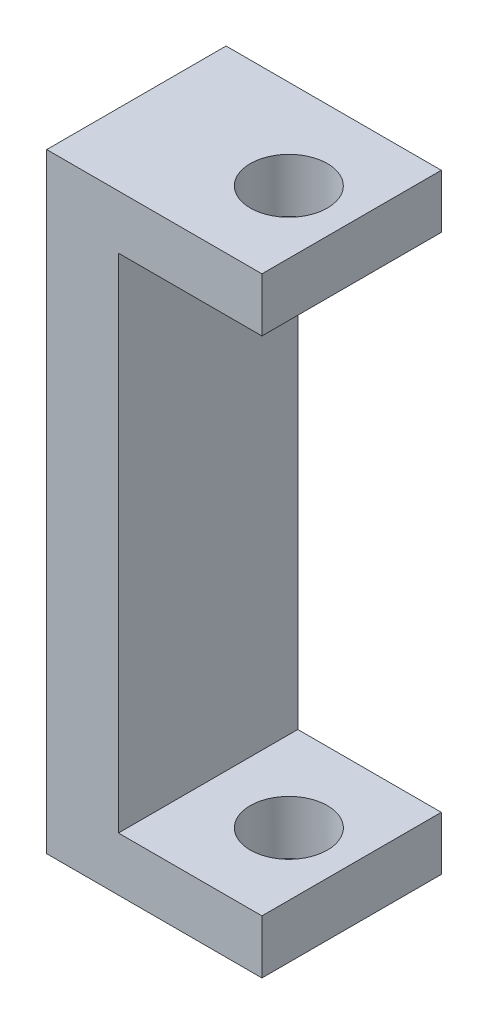
ISO-10303-21;
HEADER;
FILE_DESCRIPTION(('STEP AP214'),'2;1');
FILE_NAME('part.step','',(''),(''),'','','');
FILE_SCHEMA(('AUTOMOTIVE_DESIGN { 1 0 10303 214 1 1 1 1 }'));
ENDSEC;
DATA;
#1=APPLICATION_CONTEXT('core data for automotive mechanical design processes');
#2=APPLICATION_PROTOCOL_DEFINITION('international standard','automotive_design',2000,#1);
#3=PRODUCT_CONTEXT('',#1,'mechanical');
#4=PRODUCT('Part','Part','',(#3));
#5=PRODUCT_RELATED_PRODUCT_CATEGORY('part','',(#4));
#6=PRODUCT_DEFINITION_FORMATION('','',#4);
#7=PRODUCT_DEFINITION_CONTEXT('part definition',#1,'design');
#8=PRODUCT_DEFINITION('design','',#6,#7);
#9=PRODUCT_DEFINITION_SHAPE('','',#8);
#10=(LENGTH_UNIT() NAMED_UNIT(*) SI_UNIT(.MILLI.,.METRE.));
#11=(NAMED_UNIT(*) PLANE_ANGLE_UNIT() SI_UNIT($,.RADIAN.));
#12=(NAMED_UNIT(*) SI_UNIT($,.STERADIAN.) SOLID_ANGLE_UNIT());
#13=UNCERTAINTY_MEASURE_WITH_UNIT(LENGTH_MEASURE(1.E-05),#10,'distance_accuracy_value','');
#14=(GEOMETRIC_REPRESENTATION_CONTEXT(3) GLOBAL_UNCERTAINTY_ASSIGNED_CONTEXT((#13)) GLOBAL_UNIT_ASSIGNED_CONTEXT((#10,
#11,#12)) REPRESENTATION_CONTEXT('',''));
#15=CARTESIAN_POINT('',(0.,0.,0.));
#16=DIRECTION('',(0.,0.,1.));
#17=DIRECTION('',(1.,0.,0.));
#18=AXIS2_PLACEMENT_3D('',#15,#16,#17);
#19=CARTESIAN_POINT('',(6.,-17.,5.));
#20=DIRECTION('',(-1.,0.,0.));
#21=DIRECTION('',(0.,0.,1.));
#22=AXIS2_PLACEMENT_3D('',#19,#20,#21);
#23=PLANE('',#22);
#24=DIRECTION('',(0.,1.,0.));
#25=VECTOR('',#24,1.);
#26=CARTESIAN_POINT('',(6.,-17.,-5.));
#27=LINE('',#26,#25);
#28=CARTESIAN_POINT('',(6.,-17.,-5.));
#29=VERTEX_POINT('',#28);
#30=CARTESIAN_POINT('',(6.,-14.,-5.));
#31=VERTEX_POINT('',#30);
#32=EDGE_CURVE('E160',#29,#31,#27,.T.);
#33=ORIENTED_EDGE('',*,*,#32,.T.);
#34=DIRECTION('',(0.,0.,1.));
#35=VECTOR('',#34,1.);
#36=CARTESIAN_POINT('',(6.,-14.,5.));
#37=LINE('',#36,#35);
#38=CARTESIAN_POINT('',(6.,-14.,5.));
#39=VERTEX_POINT('',#38);
#40=EDGE_CURVE('E123',#31,#39,#37,.T.);
#41=ORIENTED_EDGE('',*,*,#40,.T.);
#42=DIRECTION('',(0.,1.,0.));
#43=VECTOR('',#42,1.);
#44=CARTESIAN_POINT('',(6.,-17.,5.));
#45=LINE('',#44,#43);
#46=CARTESIAN_POINT('',(6.,-17.,5.));
#47=VERTEX_POINT('',#46);
#48=EDGE_CURVE('E150',#47,#39,#45,.T.);
#49=ORIENTED_EDGE('',*,*,#48,.F.);
#50=DIRECTION('',(0.,0.,-1.));
#51=VECTOR('',#50,1.);
#52=CARTESIAN_POINT('',(6.,-17.,5.));
#53=LINE('',#52,#51);
#54=EDGE_CURVE('E166',#47,#29,#53,.T.);
#55=ORIENTED_EDGE('',*,*,#54,.T.);
#56=EDGE_LOOP('',(#33,#41,#49,#55));
#57=FACE_BOUND('',#56,.T.);
#58=ADVANCED_FACE('F34',(#57),#23,.F.);
#59=CARTESIAN_POINT('',(-6.,-17.,5.));
#60=DIRECTION('',(1.,0.,0.));
#61=DIRECTION('',(0.,1.,0.));
#62=AXIS2_PLACEMENT_3D('',#59,#60,#61);
#63=PLANE('',#62);
#64=DIRECTION('',(0.,-1.,0.));
#65=VECTOR('',#64,1.);
#66=CARTESIAN_POINT('',(-6.,-17.,-5.));
#67=LINE('',#66,#65);
#68=CARTESIAN_POINT('',(-6.,17.,-5.));
#69=VERTEX_POINT('',#68);
#70=CARTESIAN_POINT('',(-6.,-17.,-5.));
#71=VERTEX_POINT('',#70);
#72=EDGE_CURVE('E145',#69,#71,#67,.T.);
#73=ORIENTED_EDGE('',*,*,#72,.T.);
#74=DIRECTION('',(0.,0.,-1.));
#75=VECTOR('',#74,1.);
#76=CARTESIAN_POINT('',(-6.,-17.,5.));
#77=LINE('',#76,#75);
#78=CARTESIAN_POINT('',(-6.,-17.,5.));
#79=VERTEX_POINT('',#78);
#80=EDGE_CURVE('E43',#79,#71,#77,.T.);
#81=ORIENTED_EDGE('',*,*,#80,.F.);
#82=DIRECTION('',(0.,-1.,0.));
#83=VECTOR('',#82,1.);
#84=CARTESIAN_POINT('',(-6.,-17.,5.));
#85=LINE('',#84,#83);
#86=CARTESIAN_POINT('',(-6.,17.,5.));
#87=VERTEX_POINT('',#86);
#88=EDGE_CURVE('E146',#87,#79,#85,.T.);
#89=ORIENTED_EDGE('',*,*,#88,.F.);
#90=DIRECTION('',(0.,0.,-1.));
#91=VECTOR('',#90,1.);
#92=CARTESIAN_POINT('',(-6.,17.,5.));
#93=LINE('',#92,#91);
#94=EDGE_CURVE('E154',#87,#69,#93,.T.);
#95=ORIENTED_EDGE('',*,*,#94,.T.);
#96=EDGE_LOOP('',(#73,#81,#89,#95));
#97=FACE_BOUND('',#96,.T.);
#98=ADVANCED_FACE('F36',(#97),#63,.F.);
#99=CARTESIAN_POINT('',(6.,-17.,5.));
#100=DIRECTION('',(0.,1.,0.));
#101=DIRECTION('',(0.,0.,1.));
#102=AXIS2_PLACEMENT_3D('',#99,#100,#101);
#103=PLANE('',#102);
#104=CARTESIAN_POINT('',(2.5,-17.,0.));
#105=DIRECTION('',(0.,1.,0.));
#106=DIRECTION('',(0.,0.,1.));
#107=AXIS2_PLACEMENT_3D('',#104,#105,#106);
#108=CIRCLE('',#107,2.15);
#109=CARTESIAN_POINT('',(2.5,-17.,2.15));
#110=VERTEX_POINT('',#109);
#111=EDGE_CURVE('E205',#110,#110,#108,.T.);
#112=ORIENTED_EDGE('',*,*,#111,.T.);
#113=EDGE_LOOP('',(#112));
#114=FACE_BOUND('',#113,.T.);
#115=DIRECTION('',(1.,0.,0.));
#116=VECTOR('',#115,1.);
#117=CARTESIAN_POINT('',(6.,-17.,-5.));
#118=LINE('',#117,#116);
#119=EDGE_CURVE('E157',#71,#29,#118,.T.);
#120=ORIENTED_EDGE('',*,*,#119,.T.);
#121=ORIENTED_EDGE('',*,*,#54,.F.);
#122=DIRECTION('',(1.,0.,0.));
#123=VECTOR('',#122,1.);
#124=CARTESIAN_POINT('',(6.,-17.,5.));
#125=LINE('',#124,#123);
#126=EDGE_CURVE('E88',#79,#47,#125,.T.);
#127=ORIENTED_EDGE('',*,*,#126,.F.);
#128=ORIENTED_EDGE('',*,*,#80,.T.);
#129=EDGE_LOOP('',(#120,#121,#127,#128));
#130=FACE_BOUND('',#129,.T.);
#131=ADVANCED_FACE('F170',(#114,#130),#103,.F.);
#132=CARTESIAN_POINT('',(6.,14.,5.));
#133=VERTEX_POINT('',#132);
#134=CARTESIAN_POINT('',(6.,17.,5.));
#135=VERTEX_POINT('',#134);
#136=EDGE_CURVE('E149',#133,#135,#45,.T.);
#137=ORIENTED_EDGE('',*,*,#136,.F.);
#138=DIRECTION('',(0.,0.,-1.));
#139=VECTOR('',#138,1.);
#140=CARTESIAN_POINT('',(6.,14.,5.));
#141=LINE('',#140,#139);
#142=CARTESIAN_POINT('',(6.,14.,-5.));
#143=VERTEX_POINT('',#142);
#144=EDGE_CURVE('E138',#133,#143,#141,.T.);
#145=ORIENTED_EDGE('',*,*,#144,.T.);
#146=CARTESIAN_POINT('',(6.,17.,-5.));
#147=VERTEX_POINT('',#146);
#148=EDGE_CURVE('E159',#143,#147,#27,.T.);
#149=ORIENTED_EDGE('',*,*,#148,.T.);
#150=DIRECTION('',(0.,0.,-1.));
#151=VECTOR('',#150,1.);
#152=CARTESIAN_POINT('',(6.,17.,5.));
#153=LINE('',#152,#151);
#154=EDGE_CURVE('E164',#135,#147,#153,.T.);
#155=ORIENTED_EDGE('',*,*,#154,.F.);
#156=EDGE_LOOP('',(#137,#145,#149,#155));
#157=FACE_BOUND('',#156,.T.);
#158=ADVANCED_FACE('F182',(#157),#23,.F.);
#159=CARTESIAN_POINT('',(6.,17.,5.));
#160=DIRECTION('',(0.,-1.,0.));
#161=DIRECTION('',(0.,0.,-1.));
#162=AXIS2_PLACEMENT_3D('',#159,#160,#161);
#163=PLANE('',#162);
#164=CARTESIAN_POINT('',(2.5,17.,0.));
#165=DIRECTION('',(0.,1.,0.));
#166=DIRECTION('',(0.,0.,1.));
#167=AXIS2_PLACEMENT_3D('',#164,#165,#166);
#168=CIRCLE('',#167,2.15);
#169=CARTESIAN_POINT('',(2.5,17.,2.15));
#170=VERTEX_POINT('',#169);
#171=EDGE_CURVE('E207',#170,#170,#168,.T.);
#172=ORIENTED_EDGE('',*,*,#171,.F.);
#173=EDGE_LOOP('',(#172));
#174=FACE_BOUND('',#173,.T.);
#175=DIRECTION('',(-1.,0.,0.));
#176=VECTOR('',#175,1.);
#177=CARTESIAN_POINT('',(6.,17.,-5.));
#178=LINE('',#177,#176);
#179=EDGE_CURVE('E80',#147,#69,#178,.T.);
#180=ORIENTED_EDGE('',*,*,#179,.T.);
#181=ORIENTED_EDGE('',*,*,#94,.F.);
#182=DIRECTION('',(-1.,0.,0.));
#183=VECTOR('',#182,1.);
#184=CARTESIAN_POINT('',(6.,17.,5.));
#185=LINE('',#184,#183);
#186=EDGE_CURVE('E59',#135,#87,#185,.T.);
#187=ORIENTED_EDGE('',*,*,#186,.F.);
#188=ORIENTED_EDGE('',*,*,#154,.T.);
#189=EDGE_LOOP('',(#180,#181,#187,#188));
#190=FACE_BOUND('',#189,.T.);
#191=ADVANCED_FACE('F183',(#174,#190),#163,.F.);
#192=CARTESIAN_POINT('',(0.,0.,5.));
#193=DIRECTION('',(0.,0.,1.));
#194=DIRECTION('',(1.,0.,0.));
#195=AXIS2_PLACEMENT_3D('',#192,#193,#194);
#196=PLANE('',#195);
#197=DIRECTION('',(1.,0.,0.));
#198=VECTOR('',#197,1.);
#199=CARTESIAN_POINT('',(0.,-14.,5.));
#200=LINE('',#199,#198);
#201=CARTESIAN_POINT('',(-2.,-14.,5.));
#202=VERTEX_POINT('',#201);
#203=EDGE_CURVE('E142',#202,#39,#200,.T.);
#204=ORIENTED_EDGE('',*,*,#203,.F.);
#205=DIRECTION('',(0.,-1.,0.));
#206=VECTOR('',#205,1.);
#207=CARTESIAN_POINT('',(-2.,0.,5.));
#208=LINE('',#207,#206);
#209=CARTESIAN_POINT('',(-1.99999999999999,14.,5.));
#210=VERTEX_POINT('',#209);
#211=EDGE_CURVE('E113',#210,#202,#208,.T.);
#212=ORIENTED_EDGE('',*,*,#211,.F.);
#213=DIRECTION('',(-1.,0.,0.));
#214=VECTOR('',#213,1.);
#215=CARTESIAN_POINT('',(0.,14.,5.));
#216=LINE('',#215,#214);
#217=EDGE_CURVE('E116',#133,#210,#216,.T.);
#218=ORIENTED_EDGE('',*,*,#217,.F.);
#219=ORIENTED_EDGE('',*,*,#136,.T.);
#220=ORIENTED_EDGE('',*,*,#186,.T.);
#221=ORIENTED_EDGE('',*,*,#88,.T.);
#222=ORIENTED_EDGE('',*,*,#126,.T.);
#223=ORIENTED_EDGE('',*,*,#48,.T.);
#224=EDGE_LOOP('',(#204,#212,#218,#219,#220,#221,#222,#223));
#225=FACE_BOUND('',#224,.T.);
#226=ADVANCED_FACE('F176',(#225),#196,.T.);
#227=CARTESIAN_POINT('',(0.,0.,-5.));
#228=DIRECTION('',(0.,0.,1.));
#229=DIRECTION('',(1.,0.,0.));
#230=AXIS2_PLACEMENT_3D('',#227,#228,#229);
#231=PLANE('',#230);
#232=DIRECTION('',(0.,-1.,0.));
#233=VECTOR('',#232,1.);
#234=CARTESIAN_POINT('',(-1.99999999999999,14.,-5.));
#235=LINE('',#234,#233);
#236=CARTESIAN_POINT('',(-1.99999999999999,14.,-5.));
#237=VERTEX_POINT('',#236);
#238=CARTESIAN_POINT('',(-2.,-14.,-5.));
#239=VERTEX_POINT('',#238);
#240=EDGE_CURVE('E50',#237,#239,#235,.T.);
#241=ORIENTED_EDGE('',*,*,#240,.T.);
#242=DIRECTION('',(1.,0.,0.));
#243=VECTOR('',#242,1.);
#244=CARTESIAN_POINT('',(-2.,-14.,-5.));
#245=LINE('',#244,#243);
#246=EDGE_CURVE('E120',#239,#31,#245,.T.);
#247=ORIENTED_EDGE('',*,*,#246,.T.);
#248=ORIENTED_EDGE('',*,*,#32,.F.);
#249=ORIENTED_EDGE('',*,*,#119,.F.);
#250=ORIENTED_EDGE('',*,*,#72,.F.);
#251=ORIENTED_EDGE('',*,*,#179,.F.);
#252=ORIENTED_EDGE('',*,*,#148,.F.);
#253=DIRECTION('',(-1.,0.,0.));
#254=VECTOR('',#253,1.);
#255=CARTESIAN_POINT('',(0.,14.,-5.));
#256=LINE('',#255,#254);
#257=EDGE_CURVE('E11',#143,#237,#256,.T.);
#258=ORIENTED_EDGE('',*,*,#257,.T.);
#259=EDGE_LOOP('',(#241,#247,#248,#249,#250,#251,#252,#258));
#260=FACE_BOUND('',#259,.T.);
#261=ADVANCED_FACE('F128',(#260),#231,.F.);
#262=CARTESIAN_POINT('',(-2.,-14.,-5.));
#263=DIRECTION('',(0.,-1.,0.));
#264=DIRECTION('',(0.,0.,-1.));
#265=AXIS2_PLACEMENT_3D('',#262,#263,#264);
#266=PLANE('',#265);
#267=CARTESIAN_POINT('',(2.5,-14.,0.));
#268=DIRECTION('',(0.,-1.,0.));
#269=DIRECTION('',(0.,0.,-1.));
#270=AXIS2_PLACEMENT_3D('',#267,#268,#269);
#271=CIRCLE('',#270,2.15);
#272=CARTESIAN_POINT('',(2.5,-14.,-2.15));
#273=VERTEX_POINT('',#272);
#274=EDGE_CURVE('E130',#273,#273,#271,.T.);
#275=ORIENTED_EDGE('',*,*,#274,.T.);
#276=EDGE_LOOP('',(#275));
#277=FACE_BOUND('',#276,.T.);
#278=ORIENTED_EDGE('',*,*,#246,.F.);
#279=DIRECTION('',(0.,0.,1.));
#280=VECTOR('',#279,1.);
#281=CARTESIAN_POINT('',(-2.,-14.,-5.));
#282=LINE('',#281,#280);
#283=EDGE_CURVE('E109',#239,#202,#282,.T.);
#284=ORIENTED_EDGE('',*,*,#283,.T.);
#285=ORIENTED_EDGE('',*,*,#203,.T.);
#286=ORIENTED_EDGE('',*,*,#40,.F.);
#287=EDGE_LOOP('',(#278,#284,#285,#286));
#288=FACE_BOUND('',#287,.T.);
#289=ADVANCED_FACE('F121',(#277,#288),#266,.F.);
#290=CARTESIAN_POINT('',(-1.99999999999999,14.,-5.));
#291=DIRECTION('',(0.,1.,0.));
#292=DIRECTION('',(0.,0.,1.));
#293=AXIS2_PLACEMENT_3D('',#290,#291,#292);
#294=PLANE('',#293);
#295=CARTESIAN_POINT('',(2.5,14.,0.));
#296=DIRECTION('',(0.,1.,0.));
#297=DIRECTION('',(0.,0.,1.));
#298=AXIS2_PLACEMENT_3D('',#295,#296,#297);
#299=CIRCLE('',#298,2.15);
#300=CARTESIAN_POINT('',(2.5,14.,2.15));
#301=VERTEX_POINT('',#300);
#302=EDGE_CURVE('E38',#301,#301,#299,.T.);
#303=ORIENTED_EDGE('',*,*,#302,.T.);
#304=EDGE_LOOP('',(#303));
#305=FACE_BOUND('',#304,.T.);
#306=ORIENTED_EDGE('',*,*,#217,.T.);
#307=DIRECTION('',(0.,0.,1.));
#308=VECTOR('',#307,1.);
#309=CARTESIAN_POINT('',(-1.99999999999999,14.,-5.));
#310=LINE('',#309,#308);
#311=EDGE_CURVE('E117',#237,#210,#310,.T.);
#312=ORIENTED_EDGE('',*,*,#311,.F.);
#313=ORIENTED_EDGE('',*,*,#257,.F.);
#314=ORIENTED_EDGE('',*,*,#144,.F.);
#315=EDGE_LOOP('',(#306,#312,#313,#314));
#316=FACE_BOUND('',#315,.T.);
#317=ADVANCED_FACE('F219',(#305,#316),#294,.F.);
#318=CARTESIAN_POINT('',(-1.99999999999999,14.,-5.));
#319=DIRECTION('',(-1.,0.,0.));
#320=DIRECTION('',(0.,-1.,0.));
#321=AXIS2_PLACEMENT_3D('',#318,#319,#320);
#322=PLANE('',#321);
#323=ORIENTED_EDGE('',*,*,#211,.T.);
#324=ORIENTED_EDGE('',*,*,#283,.F.);
#325=ORIENTED_EDGE('',*,*,#240,.F.);
#326=ORIENTED_EDGE('',*,*,#311,.T.);
#327=EDGE_LOOP('',(#323,#324,#325,#326));
#328=FACE_BOUND('',#327,.T.);
#329=ADVANCED_FACE('F111',(#328),#322,.F.);
#330=CARTESIAN_POINT('',(2.5,-17.,0.));
#331=DIRECTION('',(0.,1.,0.));
#332=DIRECTION('',(0.,0.,1.));
#333=AXIS2_PLACEMENT_3D('',#330,#331,#332);
#334=CYLINDRICAL_SURFACE('',#333,2.15);
#335=ORIENTED_EDGE('',*,*,#171,.T.);
#336=EDGE_LOOP('',(#335));
#337=FACE_BOUND('',#336,.T.);
#338=ORIENTED_EDGE('',*,*,#302,.F.);
#339=EDGE_LOOP('',(#338));
#340=FACE_BOUND('',#339,.T.);
#341=ADVANCED_FACE('F212',(#337,#340),#334,.F.);
#342=ORIENTED_EDGE('',*,*,#111,.F.);
#343=EDGE_LOOP('',(#342));
#344=FACE_BOUND('',#343,.T.);
#345=ORIENTED_EDGE('',*,*,#274,.F.);
#346=EDGE_LOOP('',(#345));
#347=FACE_BOUND('',#346,.T.);
#348=ADVANCED_FACE('F215',(#344,#347),#334,.F.);
#349=CLOSED_SHELL('',(#58,#98,#131,#158,#191,#226,#261,#289,#317,#329,#341,#348));
#350=MANIFOLD_SOLID_BREP('B2',#349);
#351=ADVANCED_BREP_SHAPE_REPRESENTATION('',(#18,#350),#14);
#352=SHAPE_DEFINITION_REPRESENTATION(#9,#351);
ENDSEC;
END-ISO-10303-21;
